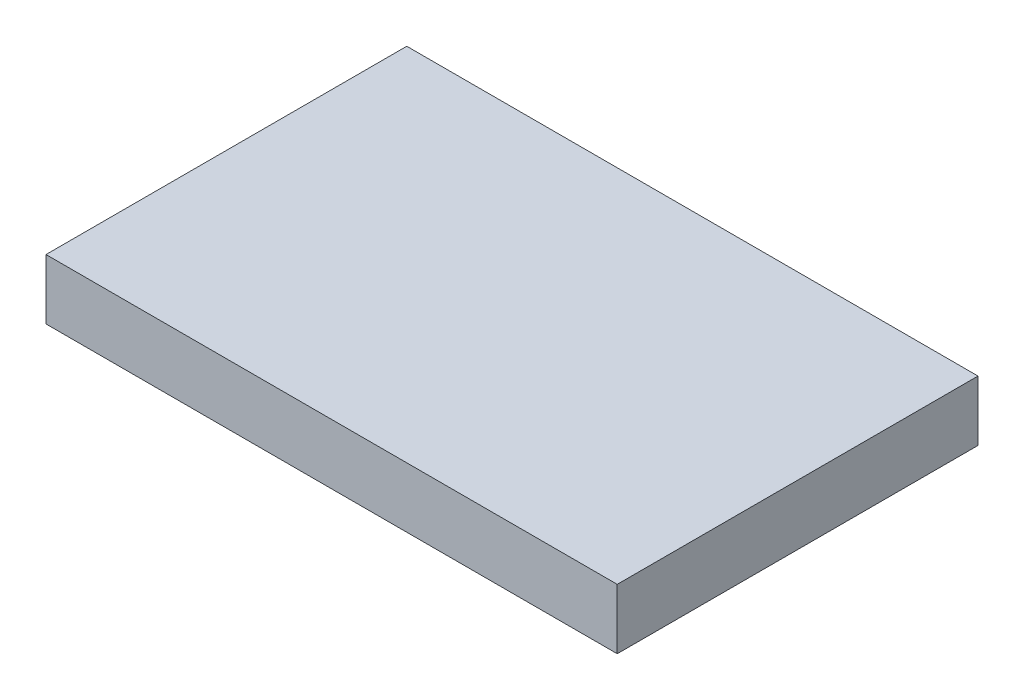
ISO-10303-21;
HEADER;
FILE_DESCRIPTION(('STEP AP214'),'2;1');
FILE_NAME('part.step','',(''),(''),'','','');
FILE_SCHEMA(('AUTOMOTIVE_DESIGN { 1 0 10303 214 1 1 1 1 }'));
ENDSEC;
DATA;
#1=APPLICATION_CONTEXT('core data for automotive mechanical design processes');
#2=APPLICATION_PROTOCOL_DEFINITION('international standard','automotive_design',2000,#1);
#3=PRODUCT_CONTEXT('',#1,'mechanical');
#4=PRODUCT('Part','Part','',(#3));
#5=PRODUCT_RELATED_PRODUCT_CATEGORY('part','',(#4));
#6=PRODUCT_DEFINITION_FORMATION('','',#4);
#7=PRODUCT_DEFINITION_CONTEXT('part definition',#1,'design');
#8=PRODUCT_DEFINITION('design','',#6,#7);
#9=PRODUCT_DEFINITION_SHAPE('','',#8);
#10=(LENGTH_UNIT() NAMED_UNIT(*) SI_UNIT(.MILLI.,.METRE.));
#11=(NAMED_UNIT(*) PLANE_ANGLE_UNIT() SI_UNIT($,.RADIAN.));
#12=(NAMED_UNIT(*) SI_UNIT($,.STERADIAN.) SOLID_ANGLE_UNIT());
#13=UNCERTAINTY_MEASURE_WITH_UNIT(LENGTH_MEASURE(1.E-05),#10,'distance_accuracy_value','');
#14=(GEOMETRIC_REPRESENTATION_CONTEXT(3) GLOBAL_UNCERTAINTY_ASSIGNED_CONTEXT((#13)) GLOBAL_UNIT_ASSIGNED_CONTEXT((#10,
#11,#12)) REPRESENTATION_CONTEXT('',''));
#15=CARTESIAN_POINT('',(0.,0.,0.));
#16=DIRECTION('',(0.,0.,1.));
#17=DIRECTION('',(1.,0.,0.));
#18=AXIS2_PLACEMENT_3D('',#15,#16,#17);
#19=CARTESIAN_POINT('',(0.,9.525,0.));
#20=DIRECTION('',(1.,0.,0.));
#21=DIRECTION('',(0.,0.,-1.));
#22=AXIS2_PLACEMENT_3D('',#19,#20,#21);
#23=PLANE('',#22);
#24=DIRECTION('',(0.,0.,1.));
#25=VECTOR('',#24,1.);
#26=CARTESIAN_POINT('',(0.,0.,0.));
#27=LINE('',#26,#25);
#28=CARTESIAN_POINT('',(0.,0.,-57.15));
#29=VERTEX_POINT('',#28);
#30=CARTESIAN_POINT('',(0.,0.,0.));
#31=VERTEX_POINT('',#30);
#32=EDGE_CURVE('E100',#29,#31,#27,.T.);
#33=ORIENTED_EDGE('',*,*,#32,.T.);
#34=DIRECTION('',(0.,-1.,0.));
#35=VECTOR('',#34,1.);
#36=CARTESIAN_POINT('',(0.,9.525,0.));
#37=LINE('',#36,#35);
#38=CARTESIAN_POINT('',(0.,9.525,0.));
#39=VERTEX_POINT('',#38);
#40=EDGE_CURVE('E11',#39,#31,#37,.T.);
#41=ORIENTED_EDGE('',*,*,#40,.F.);
#42=DIRECTION('',(0.,0.,1.));
#43=VECTOR('',#42,1.);
#44=CARTESIAN_POINT('',(0.,9.525,0.));
#45=LINE('',#44,#43);
#46=CARTESIAN_POINT('',(0.,9.525,-57.15));
#47=VERTEX_POINT('',#46);
#48=EDGE_CURVE('E88',#47,#39,#45,.T.);
#49=ORIENTED_EDGE('',*,*,#48,.F.);
#50=DIRECTION('',(0.,-1.,0.));
#51=VECTOR('',#50,1.);
#52=CARTESIAN_POINT('',(0.,9.525,-57.15));
#53=LINE('',#52,#51);
#54=EDGE_CURVE('E96',#47,#29,#53,.T.);
#55=ORIENTED_EDGE('',*,*,#54,.T.);
#56=EDGE_LOOP('',(#33,#41,#49,#55));
#57=FACE_BOUND('',#56,.T.);
#58=ADVANCED_FACE('F37',(#57),#23,.F.);
#59=CARTESIAN_POINT('',(0.,9.525,0.));
#60=DIRECTION('',(0.,0.,-1.));
#61=DIRECTION('',(-1.,0.,0.));
#62=AXIS2_PLACEMENT_3D('',#59,#60,#61);
#63=PLANE('',#62);
#64=DIRECTION('',(1.,0.,0.));
#65=VECTOR('',#64,1.);
#66=CARTESIAN_POINT('',(0.,0.,0.));
#67=LINE('',#66,#65);
#68=CARTESIAN_POINT('',(90.4875,0.,0.));
#69=VERTEX_POINT('',#68);
#70=EDGE_CURVE('E92',#31,#69,#67,.T.);
#71=ORIENTED_EDGE('',*,*,#70,.T.);
#72=DIRECTION('',(0.,-1.,0.));
#73=VECTOR('',#72,1.);
#74=CARTESIAN_POINT('',(90.4875,9.525,0.));
#75=LINE('',#74,#73);
#76=CARTESIAN_POINT('',(90.4875,9.525,0.));
#77=VERTEX_POINT('',#76);
#78=EDGE_CURVE('E45',#77,#69,#75,.T.);
#79=ORIENTED_EDGE('',*,*,#78,.F.);
#80=DIRECTION('',(1.,0.,0.));
#81=VECTOR('',#80,1.);
#82=CARTESIAN_POINT('',(0.,9.525,0.));
#83=LINE('',#82,#81);
#84=EDGE_CURVE('E83',#39,#77,#83,.T.);
#85=ORIENTED_EDGE('',*,*,#84,.F.);
#86=ORIENTED_EDGE('',*,*,#40,.T.);
#87=EDGE_LOOP('',(#71,#79,#85,#86));
#88=FACE_BOUND('',#87,.T.);
#89=ADVANCED_FACE('F91',(#88),#63,.F.);
#90=CARTESIAN_POINT('',(90.4875,9.525,0.));
#91=DIRECTION('',(-1.,0.,0.));
#92=DIRECTION('',(0.,0.,1.));
#93=AXIS2_PLACEMENT_3D('',#90,#91,#92);
#94=PLANE('',#93);
#95=DIRECTION('',(0.,0.,-1.));
#96=VECTOR('',#95,1.);
#97=CARTESIAN_POINT('',(90.4875,0.,0.));
#98=LINE('',#97,#96);
#99=CARTESIAN_POINT('',(90.4875,0.,-57.15));
#100=VERTEX_POINT('',#99);
#101=EDGE_CURVE('E70',#69,#100,#98,.T.);
#102=ORIENTED_EDGE('',*,*,#101,.T.);
#103=DIRECTION('',(0.,-1.,0.));
#104=VECTOR('',#103,1.);
#105=CARTESIAN_POINT('',(90.4875,9.525,-57.15));
#106=LINE('',#105,#104);
#107=CARTESIAN_POINT('',(90.4875,9.525,-57.15));
#108=VERTEX_POINT('',#107);
#109=EDGE_CURVE('E93',#108,#100,#106,.T.);
#110=ORIENTED_EDGE('',*,*,#109,.F.);
#111=DIRECTION('',(0.,0.,-1.));
#112=VECTOR('',#111,1.);
#113=CARTESIAN_POINT('',(90.4875,9.525,0.));
#114=LINE('',#113,#112);
#115=EDGE_CURVE('E86',#77,#108,#114,.T.);
#116=ORIENTED_EDGE('',*,*,#115,.F.);
#117=ORIENTED_EDGE('',*,*,#78,.T.);
#118=EDGE_LOOP('',(#102,#110,#116,#117));
#119=FACE_BOUND('',#118,.T.);
#120=ADVANCED_FACE('F94',(#119),#94,.F.);
#121=CARTESIAN_POINT('',(0.,9.525,-57.15));
#122=DIRECTION('',(0.,0.,1.));
#123=DIRECTION('',(1.,0.,0.));
#124=AXIS2_PLACEMENT_3D('',#121,#122,#123);
#125=PLANE('',#124);
#126=DIRECTION('',(-1.,0.,0.));
#127=VECTOR('',#126,1.);
#128=CARTESIAN_POINT('',(0.,0.,-57.15));
#129=LINE('',#128,#127);
#130=EDGE_CURVE('E76',#100,#29,#129,.T.);
#131=ORIENTED_EDGE('',*,*,#130,.T.);
#132=ORIENTED_EDGE('',*,*,#54,.F.);
#133=DIRECTION('',(-1.,0.,0.));
#134=VECTOR('',#133,1.);
#135=CARTESIAN_POINT('',(0.,9.525,-57.15));
#136=LINE('',#135,#134);
#137=EDGE_CURVE('E53',#108,#47,#136,.T.);
#138=ORIENTED_EDGE('',*,*,#137,.F.);
#139=ORIENTED_EDGE('',*,*,#109,.T.);
#140=EDGE_LOOP('',(#131,#132,#138,#139));
#141=FACE_BOUND('',#140,.T.);
#142=ADVANCED_FACE('F107',(#141),#125,.F.);
#143=CARTESIAN_POINT('',(0.,9.525,-57.15));
#144=DIRECTION('',(0.,-1.,0.));
#145=DIRECTION('',(0.,0.,-1.));
#146=AXIS2_PLACEMENT_3D('',#143,#144,#145);
#147=PLANE('',#146);
#148=ORIENTED_EDGE('',*,*,#48,.T.);
#149=ORIENTED_EDGE('',*,*,#84,.T.);
#150=ORIENTED_EDGE('',*,*,#115,.T.);
#151=ORIENTED_EDGE('',*,*,#137,.T.);
#152=EDGE_LOOP('',(#148,#149,#150,#151));
#153=FACE_BOUND('',#152,.T.);
#154=ADVANCED_FACE('F84',(#153),#147,.F.);
#155=CARTESIAN_POINT('',(0.,0.,-57.15));
#156=DIRECTION('',(0.,-1.,0.));
#157=DIRECTION('',(0.,0.,-1.));
#158=AXIS2_PLACEMENT_3D('',#155,#156,#157);
#159=PLANE('',#158);
#160=ORIENTED_EDGE('',*,*,#32,.F.);
#161=ORIENTED_EDGE('',*,*,#130,.F.);
#162=ORIENTED_EDGE('',*,*,#101,.F.);
#163=ORIENTED_EDGE('',*,*,#70,.F.);
#164=EDGE_LOOP('',(#160,#161,#162,#163));
#165=FACE_BOUND('',#164,.T.);
#166=ADVANCED_FACE('F110',(#165),#159,.T.);
#167=CLOSED_SHELL('',(#58,#89,#120,#142,#154,#166));
#168=MANIFOLD_SOLID_BREP('B2',#167);
#169=ADVANCED_BREP_SHAPE_REPRESENTATION('',(#18,#168),#14);
#170=SHAPE_DEFINITION_REPRESENTATION(#9,#169);
ENDSEC;
END-ISO-10303-21;
